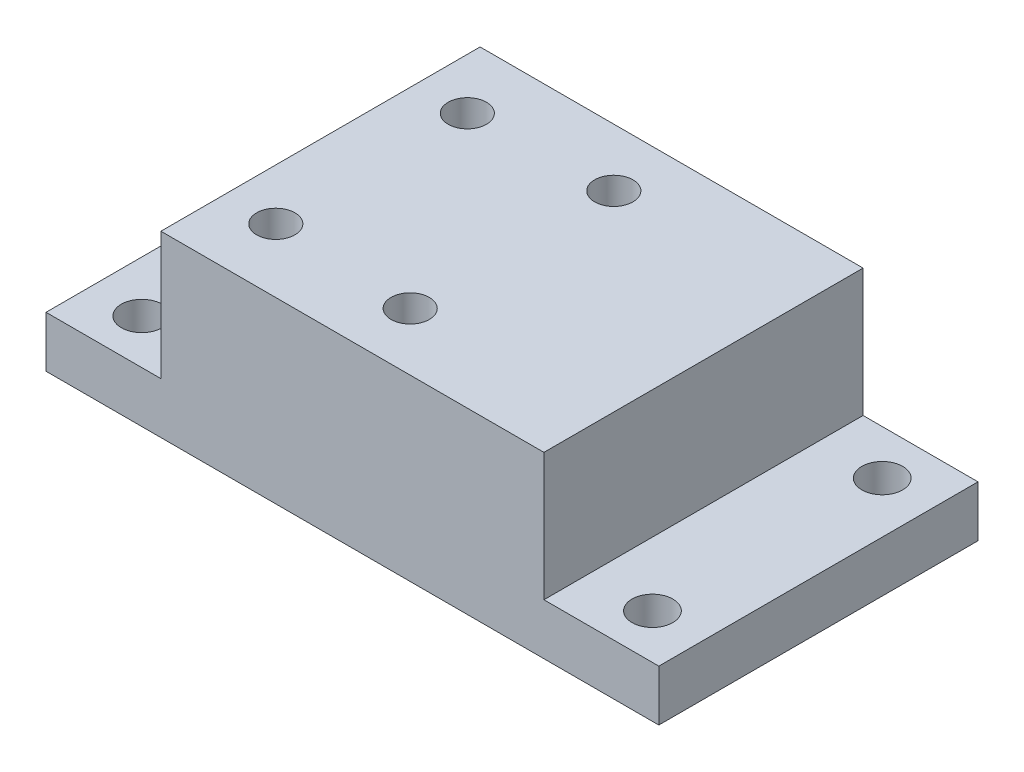
ISO-10303-21;
HEADER;
FILE_DESCRIPTION(('STEP AP214'),'2;1');
FILE_NAME('part.step','',(''),(''),'','','');
FILE_SCHEMA(('AUTOMOTIVE_DESIGN { 1 0 10303 214 1 1 1 1 }'));
ENDSEC;
DATA;
#1=APPLICATION_CONTEXT('core data for automotive mechanical design processes');
#2=APPLICATION_PROTOCOL_DEFINITION('international standard','automotive_design',2000,#1);
#3=PRODUCT_CONTEXT('',#1,'mechanical');
#4=PRODUCT('Part','Part','',(#3));
#5=PRODUCT_RELATED_PRODUCT_CATEGORY('part','',(#4));
#6=PRODUCT_DEFINITION_FORMATION('','',#4);
#7=PRODUCT_DEFINITION_CONTEXT('part definition',#1,'design');
#8=PRODUCT_DEFINITION('design','',#6,#7);
#9=PRODUCT_DEFINITION_SHAPE('','',#8);
#10=(LENGTH_UNIT() NAMED_UNIT(*) SI_UNIT(.MILLI.,.METRE.));
#11=(NAMED_UNIT(*) PLANE_ANGLE_UNIT() SI_UNIT($,.RADIAN.));
#12=(NAMED_UNIT(*) SI_UNIT($,.STERADIAN.) SOLID_ANGLE_UNIT());
#13=UNCERTAINTY_MEASURE_WITH_UNIT(LENGTH_MEASURE(1.E-05),#10,'distance_accuracy_value','');
#14=(GEOMETRIC_REPRESENTATION_CONTEXT(3) GLOBAL_UNCERTAINTY_ASSIGNED_CONTEXT((#13)) GLOBAL_UNIT_ASSIGNED_CONTEXT((#10,
#11,#12)) REPRESENTATION_CONTEXT('',''));
#15=CARTESIAN_POINT('',(0.,0.,0.));
#16=DIRECTION('',(0.,0.,1.));
#17=DIRECTION('',(1.,0.,0.));
#18=AXIS2_PLACEMENT_3D('',#15,#16,#17);
#19=CARTESIAN_POINT('',(0.,4.,0.));
#20=DIRECTION('',(0.,1.,0.));
#21=DIRECTION('',(0.,0.,1.));
#22=AXIS2_PLACEMENT_3D('',#19,#20,#21);
#23=PLANE('',#22);
#24=CARTESIAN_POINT('',(-20.,4.,-9.));
#25=DIRECTION('',(0.,1.,0.));
#26=DIRECTION('',(0.,0.,1.));
#27=AXIS2_PLACEMENT_3D('',#24,#25,#26);
#28=CIRCLE('',#27,1.6);
#29=CARTESIAN_POINT('',(-20.,4.,-7.4));
#30=VERTEX_POINT('',#29);
#31=EDGE_CURVE('E213',#30,#30,#28,.T.);
#32=ORIENTED_EDGE('',*,*,#31,.F.);
#33=EDGE_LOOP('',(#32));
#34=FACE_BOUND('',#33,.T.);
#35=CARTESIAN_POINT('',(-20.,4.,9.));
#36=DIRECTION('',(0.,1.,0.));
#37=DIRECTION('',(0.,0.,1.));
#38=AXIS2_PLACEMENT_3D('',#35,#36,#37);
#39=CIRCLE('',#38,1.6);
#40=CARTESIAN_POINT('',(-20.,4.,10.6));
#41=VERTEX_POINT('',#40);
#42=EDGE_CURVE('E188',#41,#41,#39,.T.);
#43=ORIENTED_EDGE('',*,*,#42,.F.);
#44=EDGE_LOOP('',(#43));
#45=FACE_BOUND('',#44,.T.);
#46=DIRECTION('',(0.,0.,1.));
#47=VECTOR('',#46,1.);
#48=CARTESIAN_POINT('',(-15.,4.,12.5));
#49=LINE('',#48,#47);
#50=CARTESIAN_POINT('',(-15.,4.,-12.5));
#51=VERTEX_POINT('',#50);
#52=CARTESIAN_POINT('',(-15.,4.,12.5));
#53=VERTEX_POINT('',#52);
#54=EDGE_CURVE('E50',#51,#53,#49,.T.);
#55=ORIENTED_EDGE('',*,*,#54,.F.);
#56=DIRECTION('',(-1.,0.,0.));
#57=VECTOR('',#56,1.);
#58=CARTESIAN_POINT('',(24.,4.,-12.5));
#59=LINE('',#58,#57);
#60=CARTESIAN_POINT('',(-24.,4.,-12.5));
#61=VERTEX_POINT('',#60);
#62=EDGE_CURVE('E139',#51,#61,#59,.T.);
#63=ORIENTED_EDGE('',*,*,#62,.T.);
#64=DIRECTION('',(0.,0.,1.));
#65=VECTOR('',#64,1.);
#66=CARTESIAN_POINT('',(-24.,4.,12.5));
#67=LINE('',#66,#65);
#68=CARTESIAN_POINT('',(-24.,4.,12.5));
#69=VERTEX_POINT('',#68);
#70=EDGE_CURVE('E130',#61,#69,#67,.T.);
#71=ORIENTED_EDGE('',*,*,#70,.T.);
#72=DIRECTION('',(1.,0.,0.));
#73=VECTOR('',#72,1.);
#74=CARTESIAN_POINT('',(24.,4.,12.5));
#75=LINE('',#74,#73);
#76=EDGE_CURVE('E135',#69,#53,#75,.T.);
#77=ORIENTED_EDGE('',*,*,#76,.T.);
#78=EDGE_LOOP('',(#55,#63,#71,#77));
#79=FACE_BOUND('',#78,.T.);
#80=ADVANCED_FACE('F35',(#34,#45,#79),#23,.T.);
#81=CARTESIAN_POINT('',(-24.,4.,12.5));
#82=DIRECTION('',(1.,0.,0.));
#83=DIRECTION('',(0.,0.,-1.));
#84=AXIS2_PLACEMENT_3D('',#81,#82,#83);
#85=PLANE('',#84);
#86=DIRECTION('',(0.,0.,1.));
#87=VECTOR('',#86,1.);
#88=CARTESIAN_POINT('',(-24.,0.,12.5));
#89=LINE('',#88,#87);
#90=CARTESIAN_POINT('',(-24.,0.,-12.5));
#91=VERTEX_POINT('',#90);
#92=CARTESIAN_POINT('',(-24.,0.,12.5));
#93=VERTEX_POINT('',#92);
#94=EDGE_CURVE('E121',#91,#93,#89,.T.);
#95=ORIENTED_EDGE('',*,*,#94,.T.);
#96=DIRECTION('',(0.,-1.,0.));
#97=VECTOR('',#96,1.);
#98=CARTESIAN_POINT('',(-24.,4.,12.5));
#99=LINE('',#98,#97);
#100=EDGE_CURVE('E11',#69,#93,#99,.T.);
#101=ORIENTED_EDGE('',*,*,#100,.F.);
#102=ORIENTED_EDGE('',*,*,#70,.F.);
#103=DIRECTION('',(0.,-1.,0.));
#104=VECTOR('',#103,1.);
#105=CARTESIAN_POINT('',(-24.,4.,-12.5));
#106=LINE('',#105,#104);
#107=EDGE_CURVE('E141',#61,#91,#106,.T.);
#108=ORIENTED_EDGE('',*,*,#107,.T.);
#109=EDGE_LOOP('',(#95,#101,#102,#108));
#110=FACE_BOUND('',#109,.T.);
#111=ADVANCED_FACE('F37',(#110),#85,.F.);
#112=CARTESIAN_POINT('',(24.,4.,12.5));
#113=DIRECTION('',(0.,0.,-1.));
#114=DIRECTION('',(-1.,0.,0.));
#115=AXIS2_PLACEMENT_3D('',#112,#113,#114);
#116=PLANE('',#115);
#117=DIRECTION('',(1.,0.,0.));
#118=VECTOR('',#117,1.);
#119=CARTESIAN_POINT('',(24.,0.,12.5));
#120=LINE('',#119,#118);
#121=CARTESIAN_POINT('',(24.,0.,12.5));
#122=VERTEX_POINT('',#121);
#123=EDGE_CURVE('E124',#93,#122,#120,.T.);
#124=ORIENTED_EDGE('',*,*,#123,.T.);
#125=DIRECTION('',(0.,-1.,0.));
#126=VECTOR('',#125,1.);
#127=CARTESIAN_POINT('',(24.,4.,12.5));
#128=LINE('',#127,#126);
#129=CARTESIAN_POINT('',(24.,4.,12.5));
#130=VERTEX_POINT('',#129);
#131=EDGE_CURVE('E43',#130,#122,#128,.T.);
#132=ORIENTED_EDGE('',*,*,#131,.F.);
#133=CARTESIAN_POINT('',(15.,4.,12.5));
#134=VERTEX_POINT('',#133);
#135=EDGE_CURVE('E133',#134,#130,#75,.T.);
#136=ORIENTED_EDGE('',*,*,#135,.F.);
#137=DIRECTION('',(0.,-1.,0.));
#138=VECTOR('',#137,1.);
#139=CARTESIAN_POINT('',(15.,14.,12.5));
#140=LINE('',#139,#138);
#141=CARTESIAN_POINT('',(15.,14.,12.5));
#142=VERTEX_POINT('',#141);
#143=EDGE_CURVE('E106',#142,#134,#140,.T.);
#144=ORIENTED_EDGE('',*,*,#143,.F.);
#145=DIRECTION('',(1.,0.,0.));
#146=VECTOR('',#145,1.);
#147=CARTESIAN_POINT('',(15.,14.,12.5));
#148=LINE('',#147,#146);
#149=CARTESIAN_POINT('',(-15.,14.,12.5));
#150=VERTEX_POINT('',#149);
#151=EDGE_CURVE('E100',#150,#142,#148,.T.);
#152=ORIENTED_EDGE('',*,*,#151,.F.);
#153=DIRECTION('',(0.,-1.,0.));
#154=VECTOR('',#153,1.);
#155=CARTESIAN_POINT('',(-15.,14.,12.5));
#156=LINE('',#155,#154);
#157=EDGE_CURVE('E104',#150,#53,#156,.T.);
#158=ORIENTED_EDGE('',*,*,#157,.T.);
#159=ORIENTED_EDGE('',*,*,#76,.F.);
#160=ORIENTED_EDGE('',*,*,#100,.T.);
#161=EDGE_LOOP('',(#124,#132,#136,#144,#152,#158,#159,#160));
#162=FACE_BOUND('',#161,.T.);
#163=ADVANCED_FACE('F102',(#162),#116,.F.);
#164=CARTESIAN_POINT('',(24.,4.,12.5));
#165=DIRECTION('',(-1.,0.,0.));
#166=DIRECTION('',(0.,0.,1.));
#167=AXIS2_PLACEMENT_3D('',#164,#165,#166);
#168=PLANE('',#167);
#169=DIRECTION('',(0.,0.,-1.));
#170=VECTOR('',#169,1.);
#171=CARTESIAN_POINT('',(24.,0.,12.5));
#172=LINE('',#171,#170);
#173=CARTESIAN_POINT('',(24.,0.,-12.5));
#174=VERTEX_POINT('',#173);
#175=EDGE_CURVE('E144',#122,#174,#172,.T.);
#176=ORIENTED_EDGE('',*,*,#175,.T.);
#177=DIRECTION('',(0.,-1.,0.));
#178=VECTOR('',#177,1.);
#179=CARTESIAN_POINT('',(24.,4.,-12.5));
#180=LINE('',#179,#178);
#181=CARTESIAN_POINT('',(24.,4.,-12.5));
#182=VERTEX_POINT('',#181);
#183=EDGE_CURVE('E149',#182,#174,#180,.T.);
#184=ORIENTED_EDGE('',*,*,#183,.F.);
#185=DIRECTION('',(0.,0.,-1.));
#186=VECTOR('',#185,1.);
#187=CARTESIAN_POINT('',(24.,4.,12.5));
#188=LINE('',#187,#186);
#189=EDGE_CURVE('E137',#130,#182,#188,.T.);
#190=ORIENTED_EDGE('',*,*,#189,.F.);
#191=ORIENTED_EDGE('',*,*,#131,.T.);
#192=EDGE_LOOP('',(#176,#184,#190,#191));
#193=FACE_BOUND('',#192,.T.);
#194=ADVANCED_FACE('F156',(#193),#168,.F.);
#195=CARTESIAN_POINT('',(24.,4.,-12.5));
#196=DIRECTION('',(0.,0.,1.));
#197=DIRECTION('',(1.,0.,0.));
#198=AXIS2_PLACEMENT_3D('',#195,#196,#197);
#199=PLANE('',#198);
#200=DIRECTION('',(-1.,0.,0.));
#201=VECTOR('',#200,1.);
#202=CARTESIAN_POINT('',(24.,0.,-12.5));
#203=LINE('',#202,#201);
#204=EDGE_CURVE('E134',#174,#91,#203,.T.);
#205=ORIENTED_EDGE('',*,*,#204,.T.);
#206=ORIENTED_EDGE('',*,*,#107,.F.);
#207=ORIENTED_EDGE('',*,*,#62,.F.);
#208=DIRECTION('',(0.,-1.,0.));
#209=VECTOR('',#208,1.);
#210=CARTESIAN_POINT('',(-15.,14.,-12.5));
#211=LINE('',#210,#209);
#212=CARTESIAN_POINT('',(-15.,14.,-12.5));
#213=VERTEX_POINT('',#212);
#214=EDGE_CURVE('E169',#213,#51,#211,.T.);
#215=ORIENTED_EDGE('',*,*,#214,.F.);
#216=DIRECTION('',(-1.,0.,0.));
#217=VECTOR('',#216,1.);
#218=CARTESIAN_POINT('',(15.,14.,-12.5));
#219=LINE('',#218,#217);
#220=CARTESIAN_POINT('',(15.,14.,-12.5));
#221=VERTEX_POINT('',#220);
#222=EDGE_CURVE('E115',#221,#213,#219,.T.);
#223=ORIENTED_EDGE('',*,*,#222,.F.);
#224=DIRECTION('',(0.,-1.,0.));
#225=VECTOR('',#224,1.);
#226=CARTESIAN_POINT('',(15.,14.,-12.5));
#227=LINE('',#226,#225);
#228=CARTESIAN_POINT('',(15.,4.,-12.5));
#229=VERTEX_POINT('',#228);
#230=EDGE_CURVE('E126',#221,#229,#227,.T.);
#231=ORIENTED_EDGE('',*,*,#230,.T.);
#232=EDGE_CURVE('E140',#182,#229,#59,.T.);
#233=ORIENTED_EDGE('',*,*,#232,.F.);
#234=ORIENTED_EDGE('',*,*,#183,.T.);
#235=EDGE_LOOP('',(#205,#206,#207,#215,#223,#231,#233,#234));
#236=FACE_BOUND('',#235,.T.);
#237=ADVANCED_FACE('F164',(#236),#199,.F.);
#238=CARTESIAN_POINT('',(20.,4.,9.));
#239=DIRECTION('',(0.,1.,0.));
#240=DIRECTION('',(0.,0.,1.));
#241=AXIS2_PLACEMENT_3D('',#238,#239,#240);
#242=CIRCLE('',#241,1.6);
#243=CARTESIAN_POINT('',(20.,4.,10.6));
#244=VERTEX_POINT('',#243);
#245=EDGE_CURVE('E207',#244,#244,#242,.T.);
#246=ORIENTED_EDGE('',*,*,#245,.F.);
#247=EDGE_LOOP('',(#246));
#248=FACE_BOUND('',#247,.T.);
#249=CARTESIAN_POINT('',(20.,4.,-9.));
#250=DIRECTION('',(0.,1.,0.));
#251=DIRECTION('',(0.,0.,1.));
#252=AXIS2_PLACEMENT_3D('',#249,#250,#251);
#253=CIRCLE('',#252,1.6);
#254=CARTESIAN_POINT('',(20.,4.,-7.4));
#255=VERTEX_POINT('',#254);
#256=EDGE_CURVE('E210',#255,#255,#253,.T.);
#257=ORIENTED_EDGE('',*,*,#256,.F.);
#258=EDGE_LOOP('',(#257));
#259=FACE_BOUND('',#258,.T.);
#260=DIRECTION('',(0.,0.,-1.));
#261=VECTOR('',#260,1.);
#262=CARTESIAN_POINT('',(15.,4.,12.5));
#263=LINE('',#262,#261);
#264=EDGE_CURVE('E58',#134,#229,#263,.T.);
#265=ORIENTED_EDGE('',*,*,#264,.F.);
#266=ORIENTED_EDGE('',*,*,#135,.T.);
#267=ORIENTED_EDGE('',*,*,#189,.T.);
#268=ORIENTED_EDGE('',*,*,#232,.T.);
#269=EDGE_LOOP('',(#265,#266,#267,#268));
#270=FACE_BOUND('',#269,.T.);
#271=ADVANCED_FACE('F230',(#248,#259,#270),#23,.T.);
#272=CARTESIAN_POINT('',(0.,0.,0.));
#273=DIRECTION('',(0.,1.,0.));
#274=DIRECTION('',(0.,0.,1.));
#275=AXIS2_PLACEMENT_3D('',#272,#273,#274);
#276=PLANE('',#275);
#277=CARTESIAN_POINT('',(20.,0.,9.));
#278=DIRECTION('',(0.,-1.,0.));
#279=DIRECTION('',(0.,0.,-1.));
#280=AXIS2_PLACEMENT_3D('',#277,#278,#279);
#281=CIRCLE('',#280,1.6);
#282=CARTESIAN_POINT('',(20.,0.,7.4));
#283=VERTEX_POINT('',#282);
#284=EDGE_CURVE('E216',#283,#283,#281,.T.);
#285=ORIENTED_EDGE('',*,*,#284,.F.);
#286=EDGE_LOOP('',(#285));
#287=FACE_BOUND('',#286,.T.);
#288=CARTESIAN_POINT('',(20.,0.,-9.));
#289=DIRECTION('',(0.,-1.,0.));
#290=DIRECTION('',(0.,0.,-1.));
#291=AXIS2_PLACEMENT_3D('',#288,#289,#290);
#292=CIRCLE('',#291,1.6);
#293=CARTESIAN_POINT('',(20.,0.,-10.6));
#294=VERTEX_POINT('',#293);
#295=EDGE_CURVE('E220',#294,#294,#292,.T.);
#296=ORIENTED_EDGE('',*,*,#295,.F.);
#297=EDGE_LOOP('',(#296));
#298=FACE_BOUND('',#297,.T.);
#299=CARTESIAN_POINT('',(-20.,0.,-9.));
#300=DIRECTION('',(0.,-1.,0.));
#301=DIRECTION('',(0.,0.,-1.));
#302=AXIS2_PLACEMENT_3D('',#299,#300,#301);
#303=CIRCLE('',#302,1.6);
#304=CARTESIAN_POINT('',(-20.,0.,-10.6));
#305=VERTEX_POINT('',#304);
#306=EDGE_CURVE('E217',#305,#305,#303,.T.);
#307=ORIENTED_EDGE('',*,*,#306,.F.);
#308=EDGE_LOOP('',(#307));
#309=FACE_BOUND('',#308,.T.);
#310=CARTESIAN_POINT('',(-20.,0.,9.));
#311=DIRECTION('',(0.,-1.,0.));
#312=DIRECTION('',(0.,0.,-1.));
#313=AXIS2_PLACEMENT_3D('',#310,#311,#312);
#314=CIRCLE('',#313,1.6);
#315=CARTESIAN_POINT('',(-20.,0.,7.4));
#316=VERTEX_POINT('',#315);
#317=EDGE_CURVE('E204',#316,#316,#314,.T.);
#318=ORIENTED_EDGE('',*,*,#317,.F.);
#319=EDGE_LOOP('',(#318));
#320=FACE_BOUND('',#319,.T.);
#321=CARTESIAN_POINT('',(0.,0.,7.975));
#322=DIRECTION('',(0.,1.,0.));
#323=DIRECTION('',(0.,0.,1.));
#324=AXIS2_PLACEMENT_3D('',#321,#322,#323);
#325=CIRCLE('',#324,1.5);
#326=CARTESIAN_POINT('',(0.,0.,9.475));
#327=VERTEX_POINT('',#326);
#328=EDGE_CURVE('E181',#327,#327,#325,.T.);
#329=ORIENTED_EDGE('',*,*,#328,.T.);
#330=EDGE_LOOP('',(#329));
#331=FACE_BOUND('',#330,.T.);
#332=CARTESIAN_POINT('',(-11.,0.,-7.5));
#333=DIRECTION('',(0.,1.,0.));
#334=DIRECTION('',(0.,0.,1.));
#335=AXIS2_PLACEMENT_3D('',#332,#333,#334);
#336=CIRCLE('',#335,1.5);
#337=CARTESIAN_POINT('',(-11.,0.,-6.));
#338=VERTEX_POINT('',#337);
#339=EDGE_CURVE('E194',#338,#338,#336,.T.);
#340=ORIENTED_EDGE('',*,*,#339,.T.);
#341=EDGE_LOOP('',(#340));
#342=FACE_BOUND('',#341,.T.);
#343=CARTESIAN_POINT('',(-11.,0.,7.5));
#344=DIRECTION('',(0.,1.,0.));
#345=DIRECTION('',(0.,0.,1.));
#346=AXIS2_PLACEMENT_3D('',#343,#344,#345);
#347=CIRCLE('',#346,1.5);
#348=CARTESIAN_POINT('',(-11.,0.,9.));
#349=VERTEX_POINT('',#348);
#350=EDGE_CURVE('E187',#349,#349,#347,.T.);
#351=ORIENTED_EDGE('',*,*,#350,.T.);
#352=EDGE_LOOP('',(#351));
#353=FACE_BOUND('',#352,.T.);
#354=CARTESIAN_POINT('',(0.,0.,-7.975));
#355=DIRECTION('',(0.,1.,0.));
#356=DIRECTION('',(0.,0.,1.));
#357=AXIS2_PLACEMENT_3D('',#354,#355,#356);
#358=CIRCLE('',#357,1.5);
#359=CARTESIAN_POINT('',(0.,0.,-6.475));
#360=VERTEX_POINT('',#359);
#361=EDGE_CURVE('E175',#360,#360,#358,.T.);
#362=ORIENTED_EDGE('',*,*,#361,.T.);
#363=EDGE_LOOP('',(#362));
#364=FACE_BOUND('',#363,.T.);
#365=ORIENTED_EDGE('',*,*,#94,.F.);
#366=ORIENTED_EDGE('',*,*,#204,.F.);
#367=ORIENTED_EDGE('',*,*,#175,.F.);
#368=ORIENTED_EDGE('',*,*,#123,.F.);
#369=EDGE_LOOP('',(#365,#366,#367,#368));
#370=FACE_BOUND('',#369,.T.);
#371=ADVANCED_FACE('F161',(#287,#298,#309,#320,#331,#342,#353,#364,#370),#276,.F.);
#372=CARTESIAN_POINT('',(-15.,14.,12.5));
#373=DIRECTION('',(1.,0.,0.));
#374=DIRECTION('',(0.,0.,-1.));
#375=AXIS2_PLACEMENT_3D('',#372,#373,#374);
#376=PLANE('',#375);
#377=ORIENTED_EDGE('',*,*,#54,.T.);
#378=ORIENTED_EDGE('',*,*,#157,.F.);
#379=DIRECTION('',(0.,0.,1.));
#380=VECTOR('',#379,1.);
#381=CARTESIAN_POINT('',(-15.,14.,12.5));
#382=LINE('',#381,#380);
#383=EDGE_CURVE('E110',#213,#150,#382,.T.);
#384=ORIENTED_EDGE('',*,*,#383,.F.);
#385=ORIENTED_EDGE('',*,*,#214,.T.);
#386=EDGE_LOOP('',(#377,#378,#384,#385));
#387=FACE_BOUND('',#386,.T.);
#388=ADVANCED_FACE('F120',(#387),#376,.F.);
#389=CARTESIAN_POINT('',(15.,14.,12.5));
#390=DIRECTION('',(-1.,0.,0.));
#391=DIRECTION('',(0.,0.,1.));
#392=AXIS2_PLACEMENT_3D('',#389,#390,#391);
#393=PLANE('',#392);
#394=ORIENTED_EDGE('',*,*,#264,.T.);
#395=ORIENTED_EDGE('',*,*,#230,.F.);
#396=DIRECTION('',(0.,0.,-1.));
#397=VECTOR('',#396,1.);
#398=CARTESIAN_POINT('',(15.,14.,12.5));
#399=LINE('',#398,#397);
#400=EDGE_CURVE('E109',#142,#221,#399,.T.);
#401=ORIENTED_EDGE('',*,*,#400,.F.);
#402=ORIENTED_EDGE('',*,*,#143,.T.);
#403=EDGE_LOOP('',(#394,#395,#401,#402));
#404=FACE_BOUND('',#403,.T.);
#405=ADVANCED_FACE('F254',(#404),#393,.F.);
#406=CARTESIAN_POINT('',(0.,14.,0.));
#407=DIRECTION('',(0.,1.,0.));
#408=DIRECTION('',(0.,0.,1.));
#409=AXIS2_PLACEMENT_3D('',#406,#407,#408);
#410=PLANE('',#409);
#411=CARTESIAN_POINT('',(0.,14.,7.975));
#412=DIRECTION('',(0.,1.,0.));
#413=DIRECTION('',(0.,0.,1.));
#414=AXIS2_PLACEMENT_3D('',#411,#412,#413);
#415=CIRCLE('',#414,1.5);
#416=CARTESIAN_POINT('',(0.,14.,9.475));
#417=VERTEX_POINT('',#416);
#418=EDGE_CURVE('E197',#417,#417,#415,.T.);
#419=ORIENTED_EDGE('',*,*,#418,.F.);
#420=EDGE_LOOP('',(#419));
#421=FACE_BOUND('',#420,.T.);
#422=CARTESIAN_POINT('',(-11.,14.,-7.5));
#423=DIRECTION('',(0.,1.,0.));
#424=DIRECTION('',(0.,0.,1.));
#425=AXIS2_PLACEMENT_3D('',#422,#423,#424);
#426=CIRCLE('',#425,1.5);
#427=CARTESIAN_POINT('',(-11.,14.,-6.));
#428=VERTEX_POINT('',#427);
#429=EDGE_CURVE('E191',#428,#428,#426,.T.);
#430=ORIENTED_EDGE('',*,*,#429,.F.);
#431=EDGE_LOOP('',(#430));
#432=FACE_BOUND('',#431,.T.);
#433=CARTESIAN_POINT('',(-11.,14.,7.5));
#434=DIRECTION('',(0.,1.,0.));
#435=DIRECTION('',(0.,0.,1.));
#436=AXIS2_PLACEMENT_3D('',#433,#434,#435);
#437=CIRCLE('',#436,1.5);
#438=CARTESIAN_POINT('',(-11.,14.,9.));
#439=VERTEX_POINT('',#438);
#440=EDGE_CURVE('E184',#439,#439,#437,.T.);
#441=ORIENTED_EDGE('',*,*,#440,.F.);
#442=EDGE_LOOP('',(#441));
#443=FACE_BOUND('',#442,.T.);
#444=CARTESIAN_POINT('',(0.,14.,-7.975));
#445=DIRECTION('',(0.,1.,0.));
#446=DIRECTION('',(0.,0.,1.));
#447=AXIS2_PLACEMENT_3D('',#444,#445,#446);
#448=CIRCLE('',#447,1.5);
#449=CARTESIAN_POINT('',(0.,14.,-6.475));
#450=VERTEX_POINT('',#449);
#451=EDGE_CURVE('E178',#450,#450,#448,.T.);
#452=ORIENTED_EDGE('',*,*,#451,.F.);
#453=EDGE_LOOP('',(#452));
#454=FACE_BOUND('',#453,.T.);
#455=ORIENTED_EDGE('',*,*,#383,.T.);
#456=ORIENTED_EDGE('',*,*,#151,.T.);
#457=ORIENTED_EDGE('',*,*,#400,.T.);
#458=ORIENTED_EDGE('',*,*,#222,.T.);
#459=EDGE_LOOP('',(#455,#456,#457,#458));
#460=FACE_BOUND('',#459,.T.);
#461=ADVANCED_FACE('F113',(#421,#432,#443,#454,#460),#410,.T.);
#462=CARTESIAN_POINT('',(0.,0.,-7.975));
#463=DIRECTION('',(0.,1.,0.));
#464=DIRECTION('',(0.,0.,1.));
#465=AXIS2_PLACEMENT_3D('',#462,#463,#464);
#466=CYLINDRICAL_SURFACE('',#465,1.5);
#467=ORIENTED_EDGE('',*,*,#361,.F.);
#468=EDGE_LOOP('',(#467));
#469=FACE_BOUND('',#468,.T.);
#470=ORIENTED_EDGE('',*,*,#451,.T.);
#471=EDGE_LOOP('',(#470));
#472=FACE_BOUND('',#471,.T.);
#473=ADVANCED_FACE('F246',(#469,#472),#466,.F.);
#474=CARTESIAN_POINT('',(-11.,0.,7.5));
#475=DIRECTION('',(0.,1.,0.));
#476=DIRECTION('',(0.,0.,1.));
#477=AXIS2_PLACEMENT_3D('',#474,#475,#476);
#478=CYLINDRICAL_SURFACE('',#477,1.5);
#479=ORIENTED_EDGE('',*,*,#350,.F.);
#480=EDGE_LOOP('',(#479));
#481=FACE_BOUND('',#480,.T.);
#482=ORIENTED_EDGE('',*,*,#440,.T.);
#483=EDGE_LOOP('',(#482));
#484=FACE_BOUND('',#483,.T.);
#485=ADVANCED_FACE('F249',(#481,#484),#478,.F.);
#486=CARTESIAN_POINT('',(-11.,0.,-7.5));
#487=DIRECTION('',(0.,1.,0.));
#488=DIRECTION('',(0.,0.,1.));
#489=AXIS2_PLACEMENT_3D('',#486,#487,#488);
#490=CYLINDRICAL_SURFACE('',#489,1.5);
#491=ORIENTED_EDGE('',*,*,#339,.F.);
#492=EDGE_LOOP('',(#491));
#493=FACE_BOUND('',#492,.T.);
#494=ORIENTED_EDGE('',*,*,#429,.T.);
#495=EDGE_LOOP('',(#494));
#496=FACE_BOUND('',#495,.T.);
#497=ADVANCED_FACE('F304',(#493,#496),#490,.F.);
#498=CARTESIAN_POINT('',(0.,0.,7.975));
#499=DIRECTION('',(0.,1.,0.));
#500=DIRECTION('',(0.,0.,1.));
#501=AXIS2_PLACEMENT_3D('',#498,#499,#500);
#502=CYLINDRICAL_SURFACE('',#501,1.5);
#503=ORIENTED_EDGE('',*,*,#328,.F.);
#504=EDGE_LOOP('',(#503));
#505=FACE_BOUND('',#504,.T.);
#506=ORIENTED_EDGE('',*,*,#418,.T.);
#507=EDGE_LOOP('',(#506));
#508=FACE_BOUND('',#507,.T.);
#509=ADVANCED_FACE('F300',(#505,#508),#502,.F.);
#510=CARTESIAN_POINT('',(-20.,14.,9.));
#511=DIRECTION('',(0.,-1.,0.));
#512=DIRECTION('',(0.,0.,-1.));
#513=AXIS2_PLACEMENT_3D('',#510,#511,#512);
#514=CYLINDRICAL_SURFACE('',#513,1.6);
#515=ORIENTED_EDGE('',*,*,#42,.T.);
#516=EDGE_LOOP('',(#515));
#517=FACE_BOUND('',#516,.T.);
#518=ORIENTED_EDGE('',*,*,#317,.T.);
#519=EDGE_LOOP('',(#518));
#520=FACE_BOUND('',#519,.T.);
#521=ADVANCED_FACE('F294',(#517,#520),#514,.F.);
#522=CARTESIAN_POINT('',(-20.,14.,-9.));
#523=DIRECTION('',(0.,-1.,0.));
#524=DIRECTION('',(0.,0.,-1.));
#525=AXIS2_PLACEMENT_3D('',#522,#523,#524);
#526=CYLINDRICAL_SURFACE('',#525,1.6);
#527=ORIENTED_EDGE('',*,*,#31,.T.);
#528=EDGE_LOOP('',(#527));
#529=FACE_BOUND('',#528,.T.);
#530=ORIENTED_EDGE('',*,*,#306,.T.);
#531=EDGE_LOOP('',(#530));
#532=FACE_BOUND('',#531,.T.);
#533=ADVANCED_FACE('F286',(#529,#532),#526,.F.);
#534=CARTESIAN_POINT('',(20.,14.,-9.));
#535=DIRECTION('',(0.,-1.,0.));
#536=DIRECTION('',(0.,0.,-1.));
#537=AXIS2_PLACEMENT_3D('',#534,#535,#536);
#538=CYLINDRICAL_SURFACE('',#537,1.6);
#539=ORIENTED_EDGE('',*,*,#256,.T.);
#540=EDGE_LOOP('',(#539));
#541=FACE_BOUND('',#540,.T.);
#542=ORIENTED_EDGE('',*,*,#295,.T.);
#543=EDGE_LOOP('',(#542));
#544=FACE_BOUND('',#543,.T.);
#545=ADVANCED_FACE('F283',(#541,#544),#538,.F.);
#546=CARTESIAN_POINT('',(20.,14.,9.));
#547=DIRECTION('',(0.,-1.,0.));
#548=DIRECTION('',(0.,0.,-1.));
#549=AXIS2_PLACEMENT_3D('',#546,#547,#548);
#550=CYLINDRICAL_SURFACE('',#549,1.6);
#551=ORIENTED_EDGE('',*,*,#245,.T.);
#552=EDGE_LOOP('',(#551));
#553=FACE_BOUND('',#552,.T.);
#554=ORIENTED_EDGE('',*,*,#284,.T.);
#555=EDGE_LOOP('',(#554));
#556=FACE_BOUND('',#555,.T.);
#557=ADVANCED_FACE('F226',(#553,#556),#550,.F.);
#558=CLOSED_SHELL('',(#80,#111,#163,#194,#237,#271,#371,#388,#405,#461,#473,#485,#497,#509,#521,
#533,#545,#557));
#559=MANIFOLD_SOLID_BREP('B2',#558);
#560=ADVANCED_BREP_SHAPE_REPRESENTATION('',(#18,#559),#14);
#561=SHAPE_DEFINITION_REPRESENTATION(#9,#560);
ENDSEC;
END-ISO-10303-21;
